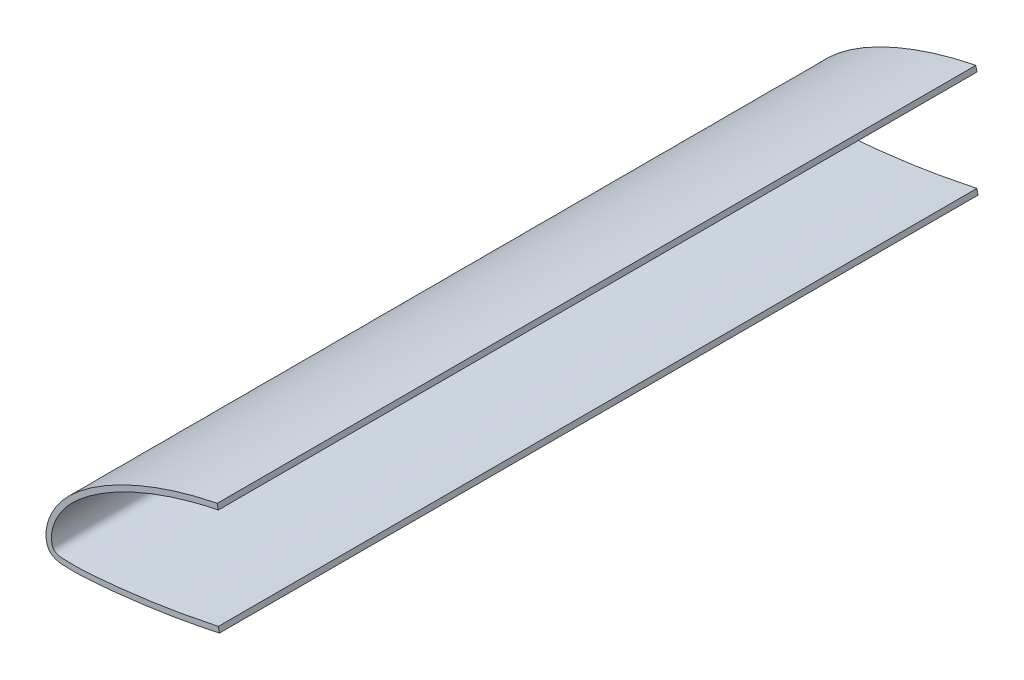
ISO-10303-21;
HEADER;
FILE_DESCRIPTION(('STEP AP214'),'2;1');
FILE_NAME('part.step','',(''),(''),'','','');
FILE_SCHEMA(('AUTOMOTIVE_DESIGN { 1 0 10303 214 1 1 1 1 }'));
ENDSEC;
DATA;
#1=APPLICATION_CONTEXT('core data for automotive mechanical design processes');
#2=APPLICATION_PROTOCOL_DEFINITION('international standard','automotive_design',2000,#1);
#3=PRODUCT_CONTEXT('',#1,'mechanical');
#4=PRODUCT('Part','Part','',(#3));
#5=PRODUCT_RELATED_PRODUCT_CATEGORY('part','',(#4));
#6=PRODUCT_DEFINITION_FORMATION('','',#4);
#7=PRODUCT_DEFINITION_CONTEXT('part definition',#1,'design');
#8=PRODUCT_DEFINITION('design','',#6,#7);
#9=PRODUCT_DEFINITION_SHAPE('','',#8);
#10=(LENGTH_UNIT() NAMED_UNIT(*) SI_UNIT(.MILLI.,.METRE.));
#11=(NAMED_UNIT(*) PLANE_ANGLE_UNIT() SI_UNIT($,.RADIAN.));
#12=(NAMED_UNIT(*) SI_UNIT($,.STERADIAN.) SOLID_ANGLE_UNIT());
#13=UNCERTAINTY_MEASURE_WITH_UNIT(LENGTH_MEASURE(1.E-05),#10,'distance_accuracy_value','');
#14=(GEOMETRIC_REPRESENTATION_CONTEXT(3) GLOBAL_UNCERTAINTY_ASSIGNED_CONTEXT((#13)) GLOBAL_UNIT_ASSIGNED_CONTEXT((#10,
#11,#12)) REPRESENTATION_CONTEXT('',''));
#15=CARTESIAN_POINT('',(0.,0.,0.));
#16=DIRECTION('',(0.,0.,1.));
#17=DIRECTION('',(1.,0.,0.));
#18=AXIS2_PLACEMENT_3D('',#15,#16,#17);
#19=CARTESIAN_POINT('',(0.,0.,279.4));
#20=CARTESIAN_POINT('',(-3.20597271749928,-0.657408310861043,279.4));
#21=CARTESIAN_POINT('',(-9.4242416568675,-1.92952750352807,279.4));
#22=CARTESIAN_POINT('',(-18.4345822064228,-3.55059718966866,279.4));
#23=CARTESIAN_POINT('',(-26.7814259009765,-4.74925325857042,279.4));
#24=CARTESIAN_POINT('',(-34.3504706657534,-5.69847380067534,279.4));
#25=CARTESIAN_POINT('',(-41.1045031091732,-6.41589500664731,279.4));
#26=CARTESIAN_POINT('',(-46.9745169849026,-6.88641489170656,279.4));
#27=CARTESIAN_POINT('',(-51.8943464997684,-7.16607138845811,279.4));
#28=CARTESIAN_POINT('',(-55.8107109866405,-7.08197250562839,279.4));
#29=CARTESIAN_POINT('',(-58.6741251100648,-6.97908637546189,279.4));
#30=CARTESIAN_POINT('',(-60.8162406190479,-5.9957109083251,279.4));
#31=CARTESIAN_POINT('',(-61.4167069322246,-3.96388156673017,279.4));
#32=CARTESIAN_POINT('',(-61.5443099780696,-1.74132104300395,279.4));
#33=CARTESIAN_POINT('',(-61.0769270222256,0.895017434323547,279.4));
#34=CARTESIAN_POINT('',(-60.0595235629834,3.75828424172116,279.4));
#35=CARTESIAN_POINT('',(-58.4522765459452,6.78131878450666,279.4));
#36=CARTESIAN_POINT('',(-56.2630412400136,9.89601769030576,279.4));
#37=CARTESIAN_POINT('',(-53.4000482047639,13.0084769402861,279.4));
#38=CARTESIAN_POINT('',(-49.8767551397383,16.0918977255158,279.4));
#39=CARTESIAN_POINT('',(-45.7453117055934,19.1786977284414,279.4));
#40=CARTESIAN_POINT('',(-41.00656068715,22.2046355418633,279.4));
#41=CARTESIAN_POINT('',(-35.6899242993275,25.1291832841534,279.4));
#42=CARTESIAN_POINT('',(-29.8240953090312,27.9195180043078,279.4));
#43=CARTESIAN_POINT('',(-23.4272511370971,30.5203691218393,279.4));
#44=CARTESIAN_POINT('',(-16.5391719796955,32.9177268400502,279.4));
#45=CARTESIAN_POINT('',(-9.1885492242057,35.0573408472089,279.4));
#46=CARTESIAN_POINT('',(-3.61161571778068,36.3797171025712,279.4));
#47=CARTESIAN_POINT('',(-0.500076223998669,37.008225690104,279.4));
#48=CARTESIAN_POINT('',(0.,37.1065042653793,279.4));
#49=B_SPLINE_CURVE_WITH_KNOTS('',3,(#19,#20,#21,#22,#23,#24,#25,#26,#27,#28,#29,#30,#31,#32,#33,
#34,#35,#36,#37,#38,#39,#40,#41,#42,#43,#44,#45,#46,#47,#48),.UNSPECIFIED.,.F.,.F.,(4,1,1,1,1,1,
1,1,1,1,1,1,1,1,1,1,1,1,1,1,1,1,1,1,1,1,1,4),(0.390258939750143,0.405633586320854,
0.420076422896871,0.433260066015854,0.445243180286776,0.45591270262434,0.465164892724559,
0.472906753114793,0.479057191933,0.483530494521586,0.486433620485735,0.489301236431444,
0.492833778575823,0.496977473856446,0.501731135416934,0.507077297393279,0.513006039296085,
0.519571578366337,0.526892246375959,0.534972669577841,0.543778468009326,0.553283961048325,
0.563461588004227,0.574277030201302,0.585708628062551,0.597710188404991,0.6102275842333,
0.612621607362344),.UNSPECIFIED.);
#50=DIRECTION('',(0.,0.,-1.));
#51=VECTOR('',#50,1.);
#52=SURFACE_OF_LINEAR_EXTRUSION('',#49,#51);
#53=CARTESIAN_POINT('',(0.,0.,0.));
#54=CARTESIAN_POINT('',(-3.20597271749928,-0.657408310861043,0.));
#55=CARTESIAN_POINT('',(-9.4242416568675,-1.92952750352807,0.));
#56=CARTESIAN_POINT('',(-18.4345822064228,-3.55059718966866,0.));
#57=CARTESIAN_POINT('',(-26.7814259009765,-4.74925325857042,0.));
#58=CARTESIAN_POINT('',(-34.3504706657534,-5.69847380067534,0.));
#59=CARTESIAN_POINT('',(-41.1045031091732,-6.41589500664731,0.));
#60=CARTESIAN_POINT('',(-46.9745169849026,-6.88641489170656,0.));
#61=CARTESIAN_POINT('',(-51.8943464997684,-7.16607138845811,0.));
#62=CARTESIAN_POINT('',(-55.8107109866405,-7.08197250562839,0.));
#63=CARTESIAN_POINT('',(-58.6741251100648,-6.97908637546189,0.));
#64=CARTESIAN_POINT('',(-60.8162406190479,-5.9957109083251,0.));
#65=CARTESIAN_POINT('',(-61.4167069322246,-3.96388156673017,0.));
#66=CARTESIAN_POINT('',(-61.5443099780696,-1.74132104300395,0.));
#67=CARTESIAN_POINT('',(-61.0769270222256,0.895017434323547,0.));
#68=CARTESIAN_POINT('',(-60.0595235629834,3.75828424172116,0.));
#69=CARTESIAN_POINT('',(-58.4522765459452,6.78131878450666,0.));
#70=CARTESIAN_POINT('',(-56.2630412400136,9.89601769030576,0.));
#71=CARTESIAN_POINT('',(-53.4000482047639,13.0084769402861,0.));
#72=CARTESIAN_POINT('',(-49.8767551397383,16.0918977255158,0.));
#73=CARTESIAN_POINT('',(-45.7453117055934,19.1786977284414,0.));
#74=CARTESIAN_POINT('',(-41.00656068715,22.2046355418633,0.));
#75=CARTESIAN_POINT('',(-35.6899242993275,25.1291832841534,0.));
#76=CARTESIAN_POINT('',(-29.8240953090312,27.9195180043078,0.));
#77=CARTESIAN_POINT('',(-23.4272511370971,30.5203691218393,0.));
#78=CARTESIAN_POINT('',(-16.5391719796955,32.9177268400502,0.));
#79=CARTESIAN_POINT('',(-9.1885492242057,35.0573408472089,0.));
#80=CARTESIAN_POINT('',(-3.61161571778068,36.3797171025712,0.));
#81=CARTESIAN_POINT('',(-0.500076223998669,37.008225690104,0.));
#82=CARTESIAN_POINT('',(0.,37.1065042653793,0.));
#83=B_SPLINE_CURVE_WITH_KNOTS('',3,(#53,#54,#55,#56,#57,#58,#59,#60,#61,#62,#63,#64,#65,#66,#67,
#68,#69,#70,#71,#72,#73,#74,#75,#76,#77,#78,#79,#80,#81,#82),.UNSPECIFIED.,.F.,.F.,(4,1,1,1,1,1,
1,1,1,1,1,1,1,1,1,1,1,1,1,1,1,1,1,1,1,1,1,4),(0.390258939750143,0.405633586320854,
0.420076422896871,0.433260066015854,0.445243180286776,0.45591270262434,0.465164892724559,
0.472906753114793,0.479057191933,0.483530494521586,0.486433620485735,0.489301236431444,
0.492833778575823,0.496977473856446,0.501731135416934,0.507077297393279,0.513006039296085,
0.519571578366337,0.526892246375959,0.534972669577841,0.543778468009326,0.553283961048325,
0.563461588004227,0.574277030201302,0.585708628062551,0.597710188404991,0.6102275842333,
0.612621607362344),.UNSPECIFIED.);
#84=CARTESIAN_POINT('',(0.,0.,0.));
#85=VERTEX_POINT('',#84);
#86=CARTESIAN_POINT('',(0.,37.1065042653792,0.));
#87=VERTEX_POINT('',#86);
#88=EDGE_CURVE('E116',#85,#87,#83,.T.);
#89=ORIENTED_EDGE('',*,*,#88,.T.);
#90=DIRECTION('',(0.,0.,-1.));
#91=VECTOR('',#90,1.);
#92=CARTESIAN_POINT('',(0.,37.1065042653792,279.4));
#93=LINE('',#92,#91);
#94=CARTESIAN_POINT('',(0.,37.1065042653792,279.4));
#95=VERTEX_POINT('',#94);
#96=EDGE_CURVE('E11',#95,#87,#93,.T.);
#97=ORIENTED_EDGE('',*,*,#96,.F.);
#98=CARTESIAN_POINT('',(0.,0.,279.4));
#99=VERTEX_POINT('',#98);
#100=EDGE_CURVE('E85',#99,#95,#49,.T.);
#101=ORIENTED_EDGE('',*,*,#100,.F.);
#102=DIRECTION('',(0.,0.,-1.));
#103=VECTOR('',#102,1.);
#104=CARTESIAN_POINT('',(0.,0.,279.4));
#105=LINE('',#104,#103);
#106=EDGE_CURVE('E93',#99,#85,#105,.T.);
#107=ORIENTED_EDGE('',*,*,#106,.T.);
#108=EDGE_LOOP('',(#89,#97,#101,#107));
#109=FACE_BOUND('',#108,.T.);
#110=ADVANCED_FACE('F33',(#109),#52,.F.);
#111=CARTESIAN_POINT('',(0.,37.1065042653792,279.4));
#112=DIRECTION('',(-0.981230514274437,-0.192838476079656,0.));
#113=DIRECTION('',(0.192838476079656,-0.981230514274437,0.));
#114=AXIS2_PLACEMENT_3D('',#111,#112,#113);
#115=PLANE('',#114);
#116=DIRECTION('',(-0.192838476079656,0.981230514274437,0.));
#117=VECTOR('',#116,1.);
#118=CARTESIAN_POINT('',(0.,37.1065042653792,0.));
#119=LINE('',#118,#117);
#120=CARTESIAN_POINT('',(-0.385480256913722,39.0679644388036,0.));
#121=VERTEX_POINT('',#120);
#122=EDGE_CURVE('E89',#87,#121,#119,.T.);
#123=ORIENTED_EDGE('',*,*,#122,.T.);
#124=DIRECTION('',(0.,0.,-1.));
#125=VECTOR('',#124,1.);
#126=CARTESIAN_POINT('',(-0.385480256913722,39.0679644388036,279.4));
#127=LINE('',#126,#125);
#128=CARTESIAN_POINT('',(-0.385480256913722,39.0679644388036,279.4));
#129=VERTEX_POINT('',#128);
#130=EDGE_CURVE('E42',#129,#121,#127,.T.);
#131=ORIENTED_EDGE('',*,*,#130,.F.);
#132=DIRECTION('',(-0.192838476079656,0.981230514274437,0.));
#133=VECTOR('',#132,1.);
#134=CARTESIAN_POINT('',(0.,37.1065042653792,279.4));
#135=LINE('',#134,#133);
#136=EDGE_CURVE('E80',#95,#129,#135,.T.);
#137=ORIENTED_EDGE('',*,*,#136,.F.);
#138=ORIENTED_EDGE('',*,*,#96,.T.);
#139=EDGE_LOOP('',(#123,#131,#137,#138));
#140=FACE_BOUND('',#139,.T.);
#141=ADVANCED_FACE('F88',(#140),#115,.F.);
#142=CARTESIAN_POINT('',(-0.385480256913722,39.0679644388036,279.4));
#143=CARTESIAN_POINT('',(-3.32754919225975,38.4897678970532,279.4));
#144=CARTESIAN_POINT('',(-9.17751103368372,37.1479348850193,279.4));
#145=CARTESIAN_POINT('',(-17.8148574947316,34.6349096702427,279.4));
#146=CARTESIAN_POINT('',(-26.2922878712234,31.6006912361193,279.4));
#147=CARTESIAN_POINT('',(-34.5717281917196,27.987174412354,279.4));
#148=CARTESIAN_POINT('',(-41.2234233043923,24.4222587777429,279.4));
#149=CARTESIAN_POINT('',(-46.3421123040063,21.1675917069838,279.4));
#150=CARTESIAN_POINT('',(-50.0420385588893,18.4919402069626,279.4));
#151=CARTESIAN_POINT('',(-53.5762494590737,15.5705155693745,279.4));
#152=CARTESIAN_POINT('',(-56.8942040487154,12.2768807581671,279.4));
#153=CARTESIAN_POINT('',(-59.3019228452825,9.13129698221763,279.4));
#154=CARTESIAN_POINT('',(-60.9279887201975,6.41191009453662,279.4));
#155=CARTESIAN_POINT('',(-61.9868283933427,4.24491460635014,279.4));
#156=CARTESIAN_POINT('',(-62.8260760733128,1.94782701398977,279.4));
#157=CARTESIAN_POINT('',(-63.3041285960134,-0.0910654020653406,279.4));
#158=CARTESIAN_POINT('',(-63.4790856126132,-1.81952593456378,279.4));
#159=CARTESIAN_POINT('',(-63.4683237440531,-3.15755595693015,279.4));
#160=CARTESIAN_POINT('',(-63.3287238414469,-4.26418283042117,279.4));
#161=CARTESIAN_POINT('',(-63.114712396514,-5.22478973868967,279.4));
#162=CARTESIAN_POINT('',(-62.8371279678437,-6.03421827272538,279.4));
#163=CARTESIAN_POINT('',(-62.3592411544565,-6.90391535865534,279.4));
#164=CARTESIAN_POINT('',(-61.5831082225768,-7.69448614299745,279.4));
#165=CARTESIAN_POINT('',(-60.7885541236323,-8.18479887440619,279.4));
#166=CARTESIAN_POINT('',(-59.7498336492966,-8.62585847228786,279.4));
#167=CARTESIAN_POINT('',(-58.5646390901317,-8.90475424118539,279.4));
#168=CARTESIAN_POINT('',(-57.2367000565585,-9.03417400606084,279.4));
#169=CARTESIAN_POINT('',(-56.0874266303364,-9.06549578137658,279.4));
#170=CARTESIAN_POINT('',(-54.6028731574877,-9.10661824010144,279.4));
#171=CARTESIAN_POINT('',(-52.6986203594891,-9.13091258879113,279.4));
#172=CARTESIAN_POINT('',(-50.4025707512056,-9.07455808169748,279.4));
#173=CARTESIAN_POINT('',(-48.1445688061582,-8.95071187414459,279.4));
#174=CARTESIAN_POINT('',(-45.9139872749751,-8.79739038219794,279.4));
#175=CARTESIAN_POINT('',(-42.9391408334588,-8.56751803067727,279.4));
#176=CARTESIAN_POINT('',(-39.22625934733,-8.22709612888324,279.4));
#177=CARTESIAN_POINT('',(-34.7869643022053,-7.74679859296936,279.4));
#178=CARTESIAN_POINT('',(-30.3592234680708,-7.21439197444015,279.4));
#179=CARTESIAN_POINT('',(-24.4682092184226,-6.4441395317069,279.4));
#180=CARTESIAN_POINT('',(-17.0966817791713,-5.35778531060357,279.4));
#181=CARTESIAN_POINT('',(-8.30410285980669,-3.74068403851358,279.4));
#182=CARTESIAN_POINT('',(-2.50326113712857,-2.55388646179148,279.4));
#183=CARTESIAN_POINT('',(0.401550199332547,-1.95823350952229,279.4));
#184=B_SPLINE_CURVE_WITH_KNOTS('',3,(#142,#143,#144,#145,#146,#147,#148,#149,#150,#151,#152,
#153,#154,#155,#156,#157,#158,#159,#160,#161,#162,#163,#164,#165,#166,#167,#168,#169,#170,#171,
#172,#173,#174,#175,#176,#177,#178,#179,#180,#181,#182,#183),.UNSPECIFIED.,.F.,.F.,(4,1,1,1,1,1,
1,1,1,1,1,1,1,1,1,1,1,1,1,1,1,1,1,1,1,1,1,1,1,1,1,1,1,1,1,1,1,1,1,4),(0.390258939750143,
0.404156606475905,0.418054273201668,0.431951939927431,0.445849606653193,0.459747273378956,
0.466696106741837,0.473644940104718,0.4805937734676,0.487542606830481,0.494491440193362,
0.497965856874803,0.501440273556243,0.504914690237684,0.508389106919125,0.510126315259845,
0.511863523600565,0.513600731941286,0.514469336111646,0.515337940282006,0.516206544452366,
0.517075148622726,0.517943752793086,0.518812356963446,0.520549565304167,0.522286773644887,
0.524023981985607,0.525761190326328,0.529235607007768,0.532710023689209,0.53618444037065,
0.53965885705209,0.543133273733531,0.550082107096412,0.557030940459293,0.563979773822175,
0.570928607185056,0.584826273910819,0.598723940636581,0.612621607362344),.UNSPECIFIED.);
#185=DIRECTION('',(0.,0.,-1.));
#186=VECTOR('',#185,1.);
#187=SURFACE_OF_LINEAR_EXTRUSION('',#184,#186);
#188=CARTESIAN_POINT('',(-0.385480256913722,39.0679644388036,0.));
#189=CARTESIAN_POINT('',(-3.32754919225975,38.4897678970532,0.));
#190=CARTESIAN_POINT('',(-9.17751103368372,37.1479348850193,0.));
#191=CARTESIAN_POINT('',(-17.8148574947316,34.6349096702427,0.));
#192=CARTESIAN_POINT('',(-26.2922878712234,31.6006912361193,0.));
#193=CARTESIAN_POINT('',(-34.5717281917196,27.987174412354,0.));
#194=CARTESIAN_POINT('',(-41.2234233043923,24.4222587777429,0.));
#195=CARTESIAN_POINT('',(-46.3421123040063,21.1675917069838,0.));
#196=CARTESIAN_POINT('',(-50.0420385588893,18.4919402069626,0.));
#197=CARTESIAN_POINT('',(-53.5762494590737,15.5705155693745,0.));
#198=CARTESIAN_POINT('',(-56.8942040487154,12.2768807581671,0.));
#199=CARTESIAN_POINT('',(-59.3019228452825,9.13129698221763,0.));
#200=CARTESIAN_POINT('',(-60.9279887201975,6.41191009453662,0.));
#201=CARTESIAN_POINT('',(-61.9868283933427,4.24491460635014,0.));
#202=CARTESIAN_POINT('',(-62.8260760733128,1.94782701398977,0.));
#203=CARTESIAN_POINT('',(-63.3041285960134,-0.0910654020653406,0.));
#204=CARTESIAN_POINT('',(-63.4790856126132,-1.81952593456378,0.));
#205=CARTESIAN_POINT('',(-63.4683237440531,-3.15755595693015,0.));
#206=CARTESIAN_POINT('',(-63.3287238414469,-4.26418283042117,0.));
#207=CARTESIAN_POINT('',(-63.114712396514,-5.22478973868967,0.));
#208=CARTESIAN_POINT('',(-62.8371279678437,-6.03421827272538,0.));
#209=CARTESIAN_POINT('',(-62.3592411544565,-6.90391535865534,0.));
#210=CARTESIAN_POINT('',(-61.5831082225768,-7.69448614299745,0.));
#211=CARTESIAN_POINT('',(-60.7885541236323,-8.18479887440619,0.));
#212=CARTESIAN_POINT('',(-59.7498336492966,-8.62585847228786,0.));
#213=CARTESIAN_POINT('',(-58.5646390901317,-8.90475424118539,0.));
#214=CARTESIAN_POINT('',(-57.2367000565585,-9.03417400606084,0.));
#215=CARTESIAN_POINT('',(-56.0874266303364,-9.06549578137658,0.));
#216=CARTESIAN_POINT('',(-54.6028731574877,-9.10661824010144,0.));
#217=CARTESIAN_POINT('',(-52.6986203594891,-9.13091258879113,0.));
#218=CARTESIAN_POINT('',(-50.4025707512056,-9.07455808169748,0.));
#219=CARTESIAN_POINT('',(-48.1445688061582,-8.95071187414459,0.));
#220=CARTESIAN_POINT('',(-45.9139872749751,-8.79739038219794,0.));
#221=CARTESIAN_POINT('',(-42.9391408334588,-8.56751803067727,0.));
#222=CARTESIAN_POINT('',(-39.22625934733,-8.22709612888324,0.));
#223=CARTESIAN_POINT('',(-34.7869643022053,-7.74679859296936,0.));
#224=CARTESIAN_POINT('',(-30.3592234680708,-7.21439197444015,0.));
#225=CARTESIAN_POINT('',(-24.4682092184226,-6.4441395317069,0.));
#226=CARTESIAN_POINT('',(-17.0966817791713,-5.35778531060357,0.));
#227=CARTESIAN_POINT('',(-8.30410285980669,-3.74068403851358,0.));
#228=CARTESIAN_POINT('',(-2.50326113712857,-2.55388646179148,0.));
#229=CARTESIAN_POINT('',(0.401550199332547,-1.95823350952229,0.));
#230=B_SPLINE_CURVE_WITH_KNOTS('',3,(#188,#189,#190,#191,#192,#193,#194,#195,#196,#197,#198,
#199,#200,#201,#202,#203,#204,#205,#206,#207,#208,#209,#210,#211,#212,#213,#214,#215,#216,#217,
#218,#219,#220,#221,#222,#223,#224,#225,#226,#227,#228,#229),.UNSPECIFIED.,.F.,.F.,(4,1,1,1,1,1,
1,1,1,1,1,1,1,1,1,1,1,1,1,1,1,1,1,1,1,1,1,1,1,1,1,1,1,1,1,1,1,1,1,4),(0.390258939750143,
0.404156606475905,0.418054273201668,0.431951939927431,0.445849606653193,0.459747273378956,
0.466696106741837,0.473644940104718,0.4805937734676,0.487542606830481,0.494491440193362,
0.497965856874803,0.501440273556243,0.504914690237684,0.508389106919125,0.510126315259845,
0.511863523600565,0.513600731941286,0.514469336111646,0.515337940282006,0.516206544452366,
0.517075148622726,0.517943752793086,0.518812356963446,0.520549565304167,0.522286773644887,
0.524023981985607,0.525761190326328,0.529235607007768,0.532710023689209,0.53618444037065,
0.53965885705209,0.543133273733531,0.550082107096412,0.557030940459293,0.563979773822175,
0.570928607185056,0.584826273910819,0.598723940636581,0.612621607362344),.UNSPECIFIED.);
#231=CARTESIAN_POINT('',(0.401550199332547,-1.95823350952229,0.));
#232=VERTEX_POINT('',#231);
#233=EDGE_CURVE('E67',#121,#232,#230,.T.);
#234=ORIENTED_EDGE('',*,*,#233,.T.);
#235=DIRECTION('',(0.,0.,-1.));
#236=VECTOR('',#235,1.);
#237=CARTESIAN_POINT('',(0.401550199332547,-1.95823350952229,279.4));
#238=LINE('',#237,#236);
#239=CARTESIAN_POINT('',(0.401550199332547,-1.95823350952229,279.4));
#240=VERTEX_POINT('',#239);
#241=EDGE_CURVE('E90',#240,#232,#238,.T.);
#242=ORIENTED_EDGE('',*,*,#241,.F.);
#243=EDGE_CURVE('E83',#129,#240,#184,.T.);
#244=ORIENTED_EDGE('',*,*,#243,.F.);
#245=ORIENTED_EDGE('',*,*,#130,.T.);
#246=EDGE_LOOP('',(#234,#242,#244,#245));
#247=FACE_BOUND('',#246,.T.);
#248=ADVANCED_FACE('F91',(#247),#187,.F.);
#249=CARTESIAN_POINT('',(0.,0.,279.4));
#250=DIRECTION('',(-0.979616359104289,-0.200877547215353,0.));
#251=DIRECTION('',(0.200877547215353,-0.979616359104289,0.));
#252=AXIS2_PLACEMENT_3D('',#249,#250,#251);
#253=PLANE('',#252);
#254=DIRECTION('',(-0.200877547215353,0.979616359104289,0.));
#255=VECTOR('',#254,1.);
#256=CARTESIAN_POINT('',(0.,0.,0.));
#257=LINE('',#256,#255);
#258=EDGE_CURVE('E73',#232,#85,#257,.T.);
#259=ORIENTED_EDGE('',*,*,#258,.T.);
#260=ORIENTED_EDGE('',*,*,#106,.F.);
#261=DIRECTION('',(-0.200877547215353,0.979616359104289,0.));
#262=VECTOR('',#261,1.);
#263=CARTESIAN_POINT('',(0.,0.,279.4));
#264=LINE('',#263,#262);
#265=EDGE_CURVE('E50',#240,#99,#264,.T.);
#266=ORIENTED_EDGE('',*,*,#265,.F.);
#267=ORIENTED_EDGE('',*,*,#241,.T.);
#268=EDGE_LOOP('',(#259,#260,#266,#267));
#269=FACE_BOUND('',#268,.T.);
#270=ADVANCED_FACE('F105',(#269),#253,.F.);
#271=CARTESIAN_POINT('',(-60.1107532413627,3.4407702600577,279.4));
#272=DIRECTION('',(0.,0.,-1.));
#273=DIRECTION('',(-1.,0.,0.));
#274=AXIS2_PLACEMENT_3D('',#271,#272,#273);
#275=PLANE('',#274);
#276=ORIENTED_EDGE('',*,*,#100,.T.);
#277=ORIENTED_EDGE('',*,*,#136,.T.);
#278=ORIENTED_EDGE('',*,*,#243,.T.);
#279=ORIENTED_EDGE('',*,*,#265,.T.);
#280=EDGE_LOOP('',(#276,#277,#278,#279));
#281=FACE_BOUND('',#280,.T.);
#282=ADVANCED_FACE('F81',(#281),#275,.F.);
#283=CARTESIAN_POINT('',(-60.1107532413627,3.4407702600577,0.));
#284=DIRECTION('',(0.,0.,-1.));
#285=DIRECTION('',(-1.,0.,0.));
#286=AXIS2_PLACEMENT_3D('',#283,#284,#285);
#287=PLANE('',#286);
#288=ORIENTED_EDGE('',*,*,#88,.F.);
#289=ORIENTED_EDGE('',*,*,#258,.F.);
#290=ORIENTED_EDGE('',*,*,#233,.F.);
#291=ORIENTED_EDGE('',*,*,#122,.F.);
#292=EDGE_LOOP('',(#288,#289,#290,#291));
#293=FACE_BOUND('',#292,.T.);
#294=ADVANCED_FACE('F133',(#293),#287,.T.);
#295=CLOSED_SHELL('',(#110,#141,#248,#270,#282,#294));
#296=MANIFOLD_SOLID_BREP('B2',#295);
#297=ADVANCED_BREP_SHAPE_REPRESENTATION('',(#18,#296),#14);
#298=SHAPE_DEFINITION_REPRESENTATION(#9,#297);
ENDSEC;
END-ISO-10303-21;
